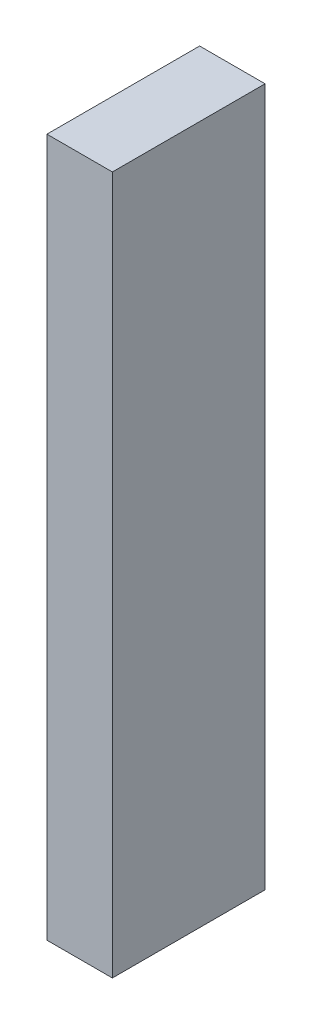
ISO-10303-21;
HEADER;
FILE_DESCRIPTION(('STEP AP214'),'2;1');
FILE_NAME('part.step','',(''),(''),'','','');
FILE_SCHEMA(('AUTOMOTIVE_DESIGN { 1 0 10303 214 1 1 1 1 }'));
ENDSEC;
DATA;
#1=APPLICATION_CONTEXT('core data for automotive mechanical design processes');
#2=APPLICATION_PROTOCOL_DEFINITION('international standard','automotive_design',2000,#1);
#3=PRODUCT_CONTEXT('',#1,'mechanical');
#4=PRODUCT('Part','Part','',(#3));
#5=PRODUCT_RELATED_PRODUCT_CATEGORY('part','',(#4));
#6=PRODUCT_DEFINITION_FORMATION('','',#4);
#7=PRODUCT_DEFINITION_CONTEXT('part definition',#1,'design');
#8=PRODUCT_DEFINITION('design','',#6,#7);
#9=PRODUCT_DEFINITION_SHAPE('','',#8);
#10=(LENGTH_UNIT() NAMED_UNIT(*) SI_UNIT(.MILLI.,.METRE.));
#11=(NAMED_UNIT(*) PLANE_ANGLE_UNIT() SI_UNIT($,.RADIAN.));
#12=(NAMED_UNIT(*) SI_UNIT($,.STERADIAN.) SOLID_ANGLE_UNIT());
#13=UNCERTAINTY_MEASURE_WITH_UNIT(LENGTH_MEASURE(1.E-05),#10,'distance_accuracy_value','');
#14=(GEOMETRIC_REPRESENTATION_CONTEXT(3) GLOBAL_UNCERTAINTY_ASSIGNED_CONTEXT((#13)) GLOBAL_UNIT_ASSIGNED_CONTEXT((#10,
#11,#12)) REPRESENTATION_CONTEXT('',''));
#15=CARTESIAN_POINT('',(0.,0.,0.));
#16=DIRECTION('',(0.,0.,1.));
#17=DIRECTION('',(1.,0.,0.));
#18=AXIS2_PLACEMENT_3D('',#15,#16,#17);
#19=CARTESIAN_POINT('',(-0.1499997,1.59999934,0.));
#20=DIRECTION('',(1.,0.,0.));
#21=DIRECTION('',(0.,0.,-1.));
#22=AXIS2_PLACEMENT_3D('',#19,#20,#21);
#23=PLANE('',#22);
#24=DIRECTION('',(0.,0.,1.));
#25=VECTOR('',#24,1.);
#26=CARTESIAN_POINT('',(-0.1499997,-1.59999934,0.));
#27=LINE('',#26,#25);
#28=CARTESIAN_POINT('',(-0.1499997,-1.59999934,0.));
#29=VERTEX_POINT('',#28);
#30=CARTESIAN_POINT('',(-0.1499997,-1.59999934,0.70000114));
#31=VERTEX_POINT('',#30);
#32=EDGE_CURVE('E19',#29,#31,#27,.T.);
#33=ORIENTED_EDGE('',*,*,#32,.T.);
#34=DIRECTION('',(0.,1.,0.));
#35=VECTOR('',#34,1.);
#36=CARTESIAN_POINT('',(-0.1499997,-1.59999934,0.70000114));
#37=LINE('',#36,#35);
#38=CARTESIAN_POINT('',(-0.1499997,1.59999934,0.70000114));
#39=VERTEX_POINT('',#38);
#40=EDGE_CURVE('E54',#31,#39,#37,.T.);
#41=ORIENTED_EDGE('',*,*,#40,.T.);
#42=DIRECTION('',(0.,0.,-1.));
#43=VECTOR('',#42,1.);
#44=CARTESIAN_POINT('',(-0.1499997,1.59999934,0.));
#45=LINE('',#44,#43);
#46=CARTESIAN_POINT('',(-0.1499997,1.59999934,0.));
#47=VERTEX_POINT('',#46);
#48=EDGE_CURVE('E73',#39,#47,#45,.T.);
#49=ORIENTED_EDGE('',*,*,#48,.T.);
#50=DIRECTION('',(0.,1.,0.));
#51=VECTOR('',#50,1.);
#52=CARTESIAN_POINT('',(-0.1499997,-1.59999934,0.));
#53=LINE('',#52,#51);
#54=EDGE_CURVE('E65',#29,#47,#53,.T.);
#55=ORIENTED_EDGE('',*,*,#54,.F.);
#56=EDGE_LOOP('',(#33,#41,#49,#55));
#57=FACE_BOUND('',#56,.T.);
#58=ADVANCED_FACE('F16',(#57),#23,.F.);
#59=CARTESIAN_POINT('',(-0.1499997,-1.59999934,0.));
#60=DIRECTION('',(0.,1.,0.));
#61=DIRECTION('',(0.,0.,1.));
#62=AXIS2_PLACEMENT_3D('',#59,#60,#61);
#63=PLANE('',#62);
#64=DIRECTION('',(0.,0.,1.));
#65=VECTOR('',#64,1.);
#66=CARTESIAN_POINT('',(0.1499997,-1.59999934,0.));
#67=LINE('',#66,#65);
#68=CARTESIAN_POINT('',(0.1499997,-1.59999934,0.));
#69=VERTEX_POINT('',#68);
#70=CARTESIAN_POINT('',(0.1499997,-1.59999934,0.70000114));
#71=VERTEX_POINT('',#70);
#72=EDGE_CURVE('E71',#69,#71,#67,.T.);
#73=ORIENTED_EDGE('',*,*,#72,.T.);
#74=DIRECTION('',(-1.,0.,0.));
#75=VECTOR('',#74,1.);
#76=CARTESIAN_POINT('',(-0.1499997,-1.59999934,0.70000114));
#77=LINE('',#76,#75);
#78=EDGE_CURVE('E61',#71,#31,#77,.T.);
#79=ORIENTED_EDGE('',*,*,#78,.T.);
#80=ORIENTED_EDGE('',*,*,#32,.F.);
#81=DIRECTION('',(-1.,0.,0.));
#82=VECTOR('',#81,1.);
#83=CARTESIAN_POINT('',(-0.1499997,-1.59999934,0.));
#84=LINE('',#83,#82);
#85=EDGE_CURVE('E79',#69,#29,#84,.T.);
#86=ORIENTED_EDGE('',*,*,#85,.F.);
#87=EDGE_LOOP('',(#73,#79,#80,#86));
#88=FACE_BOUND('',#87,.T.);
#89=ADVANCED_FACE('F70',(#88),#63,.F.);
#90=CARTESIAN_POINT('',(-0.1499997,-1.59999934,0.70000114));
#91=DIRECTION('',(0.,0.,-1.));
#92=DIRECTION('',(-1.,0.,0.));
#93=AXIS2_PLACEMENT_3D('',#90,#91,#92);
#94=PLANE('',#93);
#95=DIRECTION('',(0.,1.,0.));
#96=VECTOR('',#95,1.);
#97=CARTESIAN_POINT('',(0.1499997,-1.59999934,0.70000114));
#98=LINE('',#97,#96);
#99=CARTESIAN_POINT('',(0.1499997,1.59999934,0.70000114));
#100=VERTEX_POINT('',#99);
#101=EDGE_CURVE('E82',#71,#100,#98,.T.);
#102=ORIENTED_EDGE('',*,*,#101,.T.);
#103=DIRECTION('',(1.,0.,0.));
#104=VECTOR('',#103,1.);
#105=CARTESIAN_POINT('',(0.1499997,1.59999934,0.70000114));
#106=LINE('',#105,#104);
#107=EDGE_CURVE('E63',#100,#39,#106,.F.);
#108=ORIENTED_EDGE('',*,*,#107,.T.);
#109=ORIENTED_EDGE('',*,*,#40,.F.);
#110=ORIENTED_EDGE('',*,*,#78,.F.);
#111=EDGE_LOOP('',(#102,#108,#109,#110));
#112=FACE_BOUND('',#111,.T.);
#113=ADVANCED_FACE('F59',(#112),#94,.F.);
#114=CARTESIAN_POINT('',(0.1499997,1.59999934,0.));
#115=DIRECTION('',(0.,-1.,0.));
#116=DIRECTION('',(0.,0.,-1.));
#117=AXIS2_PLACEMENT_3D('',#114,#115,#116);
#118=PLANE('',#117);
#119=ORIENTED_EDGE('',*,*,#48,.F.);
#120=ORIENTED_EDGE('',*,*,#107,.F.);
#121=DIRECTION('',(0.,0.,1.));
#122=VECTOR('',#121,1.);
#123=CARTESIAN_POINT('',(0.1499997,1.59999934,0.));
#124=LINE('',#123,#122);
#125=CARTESIAN_POINT('',(0.1499997,1.59999934,0.));
#126=VERTEX_POINT('',#125);
#127=EDGE_CURVE('E25',#100,#126,#124,.F.);
#128=ORIENTED_EDGE('',*,*,#127,.T.);
#129=DIRECTION('',(-1.,0.,0.));
#130=VECTOR('',#129,1.);
#131=CARTESIAN_POINT('',(-0.1499997,1.59999934,0.));
#132=LINE('',#131,#130);
#133=EDGE_CURVE('E33',#47,#126,#132,.F.);
#134=ORIENTED_EDGE('',*,*,#133,.F.);
#135=EDGE_LOOP('',(#119,#120,#128,#134));
#136=FACE_BOUND('',#135,.T.);
#137=ADVANCED_FACE('F87',(#136),#118,.F.);
#138=CARTESIAN_POINT('',(-0.1499997,-1.59999934,0.));
#139=DIRECTION('',(0.,0.,-1.));
#140=DIRECTION('',(-1.,0.,0.));
#141=AXIS2_PLACEMENT_3D('',#138,#139,#140);
#142=PLANE('',#141);
#143=DIRECTION('',(0.,1.,0.));
#144=VECTOR('',#143,1.);
#145=CARTESIAN_POINT('',(0.1499997,-1.59999934,0.));
#146=LINE('',#145,#144);
#147=EDGE_CURVE('E11',#126,#69,#146,.F.);
#148=ORIENTED_EDGE('',*,*,#147,.T.);
#149=ORIENTED_EDGE('',*,*,#85,.T.);
#150=ORIENTED_EDGE('',*,*,#54,.T.);
#151=ORIENTED_EDGE('',*,*,#133,.T.);
#152=EDGE_LOOP('',(#148,#149,#150,#151));
#153=FACE_BOUND('',#152,.T.);
#154=ADVANCED_FACE('F90',(#153),#142,.T.);
#155=CARTESIAN_POINT('',(0.1499997,-1.59999934,0.));
#156=DIRECTION('',(-1.,0.,0.));
#157=DIRECTION('',(0.,0.,1.));
#158=AXIS2_PLACEMENT_3D('',#155,#156,#157);
#159=PLANE('',#158);
#160=ORIENTED_EDGE('',*,*,#127,.F.);
#161=ORIENTED_EDGE('',*,*,#101,.F.);
#162=ORIENTED_EDGE('',*,*,#72,.F.);
#163=ORIENTED_EDGE('',*,*,#147,.F.);
#164=EDGE_LOOP('',(#160,#161,#162,#163));
#165=FACE_BOUND('',#164,.T.);
#166=ADVANCED_FACE('F89',(#165),#159,.F.);
#167=CLOSED_SHELL('',(#58,#89,#113,#137,#154,#166));
#168=MANIFOLD_SOLID_BREP('B1',#167);
#169=ADVANCED_BREP_SHAPE_REPRESENTATION('',(#18,#168),#14);
#170=SHAPE_DEFINITION_REPRESENTATION(#9,#169);
ENDSEC;
END-ISO-10303-21;
